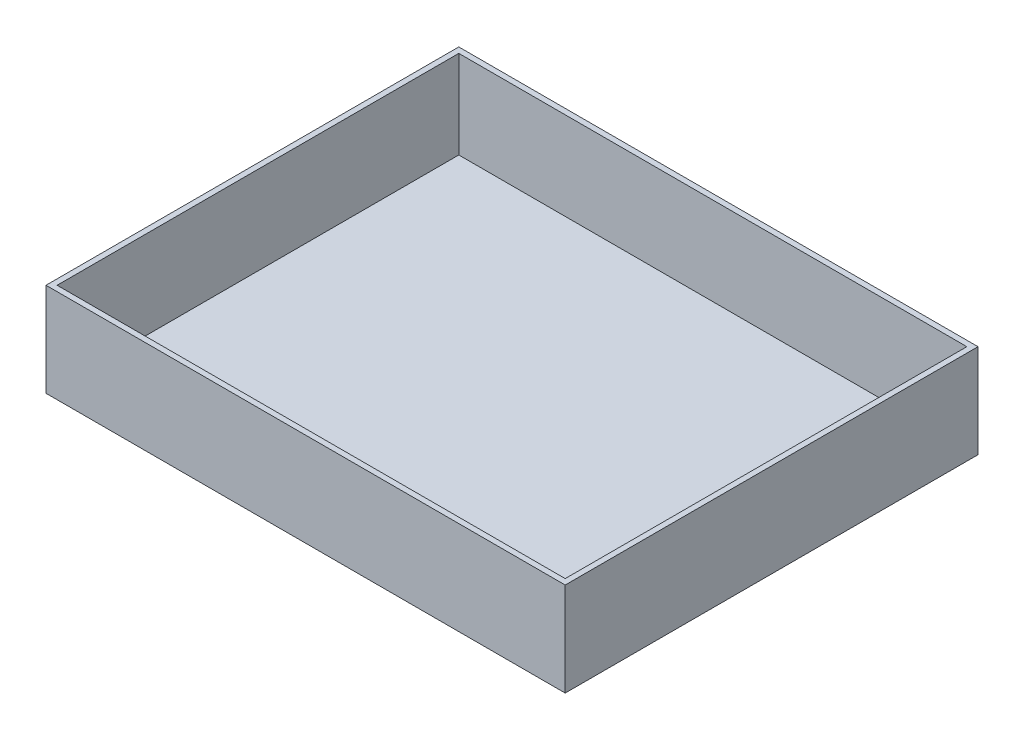
ISO-10303-21;
HEADER;
FILE_DESCRIPTION(('STEP AP214'),'2;1');
FILE_NAME('part.step','',(''),(''),'','','');
FILE_SCHEMA(('AUTOMOTIVE_DESIGN { 1 0 10303 214 1 1 1 1 }'));
ENDSEC;
DATA;
#1=APPLICATION_CONTEXT('core data for automotive mechanical design processes');
#2=APPLICATION_PROTOCOL_DEFINITION('international standard','automotive_design',2000,#1);
#3=PRODUCT_CONTEXT('',#1,'mechanical');
#4=PRODUCT('Part','Part','',(#3));
#5=PRODUCT_RELATED_PRODUCT_CATEGORY('part','',(#4));
#6=PRODUCT_DEFINITION_FORMATION('','',#4);
#7=PRODUCT_DEFINITION_CONTEXT('part definition',#1,'design');
#8=PRODUCT_DEFINITION('design','',#6,#7);
#9=PRODUCT_DEFINITION_SHAPE('','',#8);
#10=(LENGTH_UNIT() NAMED_UNIT(*) SI_UNIT(.MILLI.,.METRE.));
#11=(NAMED_UNIT(*) PLANE_ANGLE_UNIT() SI_UNIT($,.RADIAN.));
#12=(NAMED_UNIT(*) SI_UNIT($,.STERADIAN.) SOLID_ANGLE_UNIT());
#13=UNCERTAINTY_MEASURE_WITH_UNIT(LENGTH_MEASURE(1.E-05),#10,'distance_accuracy_value','');
#14=(GEOMETRIC_REPRESENTATION_CONTEXT(3) GLOBAL_UNCERTAINTY_ASSIGNED_CONTEXT((#13)) GLOBAL_UNIT_ASSIGNED_CONTEXT((#10,
#11,#12)) REPRESENTATION_CONTEXT('',''));
#15=CARTESIAN_POINT('',(0.,0.,0.));
#16=DIRECTION('',(0.,0.,1.));
#17=DIRECTION('',(1.,0.,0.));
#18=AXIS2_PLACEMENT_3D('',#15,#16,#17);
#19=CARTESIAN_POINT('',(0.,84.,0.));
#20=DIRECTION('',(-1.,0.,0.));
#21=DIRECTION('',(0.,0.,1.));
#22=AXIS2_PLACEMENT_3D('',#19,#20,#21);
#23=PLANE('',#22);
#24=DIRECTION('',(0.,0.,-1.));
#25=VECTOR('',#24,1.);
#26=CARTESIAN_POINT('',(0.,0.,0.));
#27=LINE('',#26,#25);
#28=CARTESIAN_POINT('',(0.,0.,0.));
#29=VERTEX_POINT('',#28);
#30=CARTESIAN_POINT('',(0.,0.,-370.5));
#31=VERTEX_POINT('',#30);
#32=EDGE_CURVE('E156',#29,#31,#27,.T.);
#33=ORIENTED_EDGE('',*,*,#32,.F.);
#34=DIRECTION('',(0.,-1.,0.));
#35=VECTOR('',#34,1.);
#36=CARTESIAN_POINT('',(0.,84.,0.));
#37=LINE('',#36,#35);
#38=CARTESIAN_POINT('',(0.,84.,0.));
#39=VERTEX_POINT('',#38);
#40=EDGE_CURVE('E11',#39,#29,#37,.T.);
#41=ORIENTED_EDGE('',*,*,#40,.F.);
#42=DIRECTION('',(0.,0.,-1.));
#43=VECTOR('',#42,1.);
#44=CARTESIAN_POINT('',(0.,84.,0.));
#45=LINE('',#44,#43);
#46=CARTESIAN_POINT('',(0.,84.,-370.5));
#47=VERTEX_POINT('',#46);
#48=EDGE_CURVE('E162',#39,#47,#45,.T.);
#49=ORIENTED_EDGE('',*,*,#48,.T.);
#50=DIRECTION('',(0.,-1.,0.));
#51=VECTOR('',#50,1.);
#52=CARTESIAN_POINT('',(0.,84.,-370.5));
#53=LINE('',#52,#51);
#54=EDGE_CURVE('E42',#47,#31,#53,.T.);
#55=ORIENTED_EDGE('',*,*,#54,.T.);
#56=EDGE_LOOP('',(#33,#41,#49,#55));
#57=FACE_BOUND('',#56,.T.);
#58=ADVANCED_FACE('F39',(#57),#23,.T.);
#59=CARTESIAN_POINT('',(0.,84.,0.));
#60=DIRECTION('',(0.,0.,-1.));
#61=DIRECTION('',(-1.,0.,0.));
#62=AXIS2_PLACEMENT_3D('',#59,#60,#61);
#63=PLANE('',#62);
#64=DIRECTION('',(1.,0.,0.));
#65=VECTOR('',#64,1.);
#66=CARTESIAN_POINT('',(0.,0.,0.));
#67=LINE('',#66,#65);
#68=CARTESIAN_POINT('',(466.,0.,0.));
#69=VERTEX_POINT('',#68);
#70=EDGE_CURVE('E166',#29,#69,#67,.T.);
#71=ORIENTED_EDGE('',*,*,#70,.T.);
#72=DIRECTION('',(0.,-1.,0.));
#73=VECTOR('',#72,1.);
#74=CARTESIAN_POINT('',(466.,84.,0.));
#75=LINE('',#74,#73);
#76=CARTESIAN_POINT('',(466.,84.,0.));
#77=VERTEX_POINT('',#76);
#78=EDGE_CURVE('E48',#77,#69,#75,.T.);
#79=ORIENTED_EDGE('',*,*,#78,.F.);
#80=DIRECTION('',(1.,0.,0.));
#81=VECTOR('',#80,1.);
#82=CARTESIAN_POINT('',(0.,84.,0.));
#83=LINE('',#82,#81);
#84=EDGE_CURVE('E172',#39,#77,#83,.T.);
#85=ORIENTED_EDGE('',*,*,#84,.F.);
#86=ORIENTED_EDGE('',*,*,#40,.T.);
#87=EDGE_LOOP('',(#71,#79,#85,#86));
#88=FACE_BOUND('',#87,.T.);
#89=ADVANCED_FACE('F200',(#88),#63,.F.);
#90=CARTESIAN_POINT('',(466.,84.,0.));
#91=DIRECTION('',(-1.,0.,0.));
#92=DIRECTION('',(0.,0.,1.));
#93=AXIS2_PLACEMENT_3D('',#90,#91,#92);
#94=PLANE('',#93);
#95=DIRECTION('',(0.,0.,-1.));
#96=VECTOR('',#95,1.);
#97=CARTESIAN_POINT('',(466.,0.,0.));
#98=LINE('',#97,#96);
#99=CARTESIAN_POINT('',(466.,0.,-370.5));
#100=VERTEX_POINT('',#99);
#101=EDGE_CURVE('E182',#69,#100,#98,.T.);
#102=ORIENTED_EDGE('',*,*,#101,.T.);
#103=DIRECTION('',(0.,-1.,0.));
#104=VECTOR('',#103,1.);
#105=CARTESIAN_POINT('',(466.,84.,-370.5));
#106=LINE('',#105,#104);
#107=CARTESIAN_POINT('',(466.,84.,-370.5));
#108=VERTEX_POINT('',#107);
#109=EDGE_CURVE('E190',#108,#100,#106,.T.);
#110=ORIENTED_EDGE('',*,*,#109,.F.);
#111=DIRECTION('',(0.,0.,-1.));
#112=VECTOR('',#111,1.);
#113=CARTESIAN_POINT('',(466.,84.,0.));
#114=LINE('',#113,#112);
#115=EDGE_CURVE('E169',#77,#108,#114,.T.);
#116=ORIENTED_EDGE('',*,*,#115,.F.);
#117=ORIENTED_EDGE('',*,*,#78,.T.);
#118=EDGE_LOOP('',(#102,#110,#116,#117));
#119=FACE_BOUND('',#118,.T.);
#120=ADVANCED_FACE('F203',(#119),#94,.F.);
#121=CARTESIAN_POINT('',(0.,84.,-370.5));
#122=DIRECTION('',(0.,0.,-1.));
#123=DIRECTION('',(-1.,0.,0.));
#124=AXIS2_PLACEMENT_3D('',#121,#122,#123);
#125=PLANE('',#124);
#126=DIRECTION('',(1.,0.,0.));
#127=VECTOR('',#126,1.);
#128=CARTESIAN_POINT('',(0.,0.,-370.5));
#129=LINE('',#128,#127);
#130=EDGE_CURVE('E178',#31,#100,#129,.T.);
#131=ORIENTED_EDGE('',*,*,#130,.F.);
#132=ORIENTED_EDGE('',*,*,#54,.F.);
#133=DIRECTION('',(1.,0.,0.));
#134=VECTOR('',#133,1.);
#135=CARTESIAN_POINT('',(0.,84.,-370.5));
#136=LINE('',#135,#134);
#137=EDGE_CURVE('E165',#47,#108,#136,.T.);
#138=ORIENTED_EDGE('',*,*,#137,.T.);
#139=ORIENTED_EDGE('',*,*,#109,.T.);
#140=EDGE_LOOP('',(#131,#132,#138,#139));
#141=FACE_BOUND('',#140,.T.);
#142=ADVANCED_FACE('F195',(#141),#125,.T.);
#143=CARTESIAN_POINT('',(0.,84.,0.));
#144=DIRECTION('',(0.,-1.,0.));
#145=DIRECTION('',(0.,0.,-1.));
#146=AXIS2_PLACEMENT_3D('',#143,#144,#145);
#147=PLANE('',#146);
#148=DIRECTION('',(1.,0.,0.));
#149=VECTOR('',#148,1.);
#150=CARTESIAN_POINT('',(5.,84.,-5.));
#151=LINE('',#150,#149);
#152=CARTESIAN_POINT('',(5.,84.,-5.));
#153=VERTEX_POINT('',#152);
#154=CARTESIAN_POINT('',(461.,84.,-5.));
#155=VERTEX_POINT('',#154);
#156=EDGE_CURVE('E147',#153,#155,#151,.T.);
#157=ORIENTED_EDGE('',*,*,#156,.F.);
#158=DIRECTION('',(0.,0.,1.));
#159=VECTOR('',#158,1.);
#160=CARTESIAN_POINT('',(5.,84.,-5.));
#161=LINE('',#160,#159);
#162=CARTESIAN_POINT('',(5.,84.,-365.5));
#163=VERTEX_POINT('',#162);
#164=EDGE_CURVE('E56',#163,#153,#161,.T.);
#165=ORIENTED_EDGE('',*,*,#164,.F.);
#166=DIRECTION('',(-1.,0.,0.));
#167=VECTOR('',#166,1.);
#168=CARTESIAN_POINT('',(5.,84.,-365.5));
#169=LINE('',#168,#167);
#170=CARTESIAN_POINT('',(461.,84.,-365.5));
#171=VERTEX_POINT('',#170);
#172=EDGE_CURVE('E134',#171,#163,#169,.T.);
#173=ORIENTED_EDGE('',*,*,#172,.F.);
#174=DIRECTION('',(0.,0.,-1.));
#175=VECTOR('',#174,1.);
#176=CARTESIAN_POINT('',(461.,84.,-5.));
#177=LINE('',#176,#175);
#178=EDGE_CURVE('E138',#155,#171,#177,.T.);
#179=ORIENTED_EDGE('',*,*,#178,.F.);
#180=EDGE_LOOP('',(#157,#165,#173,#179));
#181=FACE_BOUND('',#180,.T.);
#182=ORIENTED_EDGE('',*,*,#48,.F.);
#183=ORIENTED_EDGE('',*,*,#84,.T.);
#184=ORIENTED_EDGE('',*,*,#115,.T.);
#185=ORIENTED_EDGE('',*,*,#137,.F.);
#186=EDGE_LOOP('',(#182,#183,#184,#185));
#187=FACE_BOUND('',#186,.T.);
#188=ADVANCED_FACE('F205',(#181,#187),#147,.F.);
#189=CARTESIAN_POINT('',(0.,0.,0.));
#190=DIRECTION('',(0.,-1.,0.));
#191=DIRECTION('',(0.,0.,-1.));
#192=AXIS2_PLACEMENT_3D('',#189,#190,#191);
#193=PLANE('',#192);
#194=ORIENTED_EDGE('',*,*,#32,.T.);
#195=ORIENTED_EDGE('',*,*,#130,.T.);
#196=ORIENTED_EDGE('',*,*,#101,.F.);
#197=ORIENTED_EDGE('',*,*,#70,.F.);
#198=EDGE_LOOP('',(#194,#195,#196,#197));
#199=FACE_BOUND('',#198,.T.);
#200=ADVANCED_FACE('F198',(#199),#193,.T.);
#201=CARTESIAN_POINT('',(5.,5.,-5.));
#202=DIRECTION('',(-1.,0.,0.));
#203=DIRECTION('',(0.,0.,1.));
#204=AXIS2_PLACEMENT_3D('',#201,#202,#203);
#205=PLANE('',#204);
#206=ORIENTED_EDGE('',*,*,#164,.T.);
#207=DIRECTION('',(0.,1.,0.));
#208=VECTOR('',#207,1.);
#209=CARTESIAN_POINT('',(5.,5.,-5.));
#210=LINE('',#209,#208);
#211=CARTESIAN_POINT('',(5.,5.,-5.));
#212=VERTEX_POINT('',#211);
#213=EDGE_CURVE('E109',#212,#153,#210,.T.);
#214=ORIENTED_EDGE('',*,*,#213,.F.);
#215=DIRECTION('',(0.,0.,1.));
#216=VECTOR('',#215,1.);
#217=CARTESIAN_POINT('',(5.,5.,-5.));
#218=LINE('',#217,#216);
#219=CARTESIAN_POINT('',(5.,5.,-365.5));
#220=VERTEX_POINT('',#219);
#221=EDGE_CURVE('E113',#220,#212,#218,.T.);
#222=ORIENTED_EDGE('',*,*,#221,.F.);
#223=DIRECTION('',(0.,1.,0.));
#224=VECTOR('',#223,1.);
#225=CARTESIAN_POINT('',(5.,5.,-365.5));
#226=LINE('',#225,#224);
#227=EDGE_CURVE('E153',#220,#163,#226,.T.);
#228=ORIENTED_EDGE('',*,*,#227,.T.);
#229=EDGE_LOOP('',(#206,#214,#222,#228));
#230=FACE_BOUND('',#229,.T.);
#231=ADVANCED_FACE('F111',(#230),#205,.F.);
#232=CARTESIAN_POINT('',(5.,5.,-365.5));
#233=DIRECTION('',(0.,0.,-1.));
#234=DIRECTION('',(-1.,0.,0.));
#235=AXIS2_PLACEMENT_3D('',#232,#233,#234);
#236=PLANE('',#235);
#237=ORIENTED_EDGE('',*,*,#172,.T.);
#238=ORIENTED_EDGE('',*,*,#227,.F.);
#239=DIRECTION('',(-1.,0.,0.));
#240=VECTOR('',#239,1.);
#241=CARTESIAN_POINT('',(5.,5.,-365.5));
#242=LINE('',#241,#240);
#243=CARTESIAN_POINT('',(461.,5.,-365.5));
#244=VERTEX_POINT('',#243);
#245=EDGE_CURVE('E120',#244,#220,#242,.T.);
#246=ORIENTED_EDGE('',*,*,#245,.F.);
#247=DIRECTION('',(0.,1.,0.));
#248=VECTOR('',#247,1.);
#249=CARTESIAN_POINT('',(461.,5.,-365.5));
#250=LINE('',#249,#248);
#251=EDGE_CURVE('E157',#244,#171,#250,.T.);
#252=ORIENTED_EDGE('',*,*,#251,.T.);
#253=EDGE_LOOP('',(#237,#238,#246,#252));
#254=FACE_BOUND('',#253,.T.);
#255=ADVANCED_FACE('F249',(#254),#236,.F.);
#256=CARTESIAN_POINT('',(461.,5.,-5.));
#257=DIRECTION('',(1.,0.,0.));
#258=DIRECTION('',(0.,0.,-1.));
#259=AXIS2_PLACEMENT_3D('',#256,#257,#258);
#260=PLANE('',#259);
#261=ORIENTED_EDGE('',*,*,#178,.T.);
#262=ORIENTED_EDGE('',*,*,#251,.F.);
#263=DIRECTION('',(0.,0.,-1.));
#264=VECTOR('',#263,1.);
#265=CARTESIAN_POINT('',(461.,5.,-5.));
#266=LINE('',#265,#264);
#267=CARTESIAN_POINT('',(461.,5.,-5.));
#268=VERTEX_POINT('',#267);
#269=EDGE_CURVE('E129',#268,#244,#266,.T.);
#270=ORIENTED_EDGE('',*,*,#269,.F.);
#271=DIRECTION('',(0.,1.,0.));
#272=VECTOR('',#271,1.);
#273=CARTESIAN_POINT('',(461.,5.,-5.));
#274=LINE('',#273,#272);
#275=EDGE_CURVE('E119',#268,#155,#274,.T.);
#276=ORIENTED_EDGE('',*,*,#275,.T.);
#277=EDGE_LOOP('',(#261,#262,#270,#276));
#278=FACE_BOUND('',#277,.T.);
#279=ADVANCED_FACE('F257',(#278),#260,.F.);
#280=CARTESIAN_POINT('',(5.,5.,-5.));
#281=DIRECTION('',(0.,0.,1.));
#282=DIRECTION('',(1.,0.,0.));
#283=AXIS2_PLACEMENT_3D('',#280,#281,#282);
#284=PLANE('',#283);
#285=ORIENTED_EDGE('',*,*,#156,.T.);
#286=ORIENTED_EDGE('',*,*,#275,.F.);
#287=DIRECTION('',(1.,0.,0.));
#288=VECTOR('',#287,1.);
#289=CARTESIAN_POINT('',(5.,5.,-5.));
#290=LINE('',#289,#288);
#291=EDGE_CURVE('E123',#212,#268,#290,.T.);
#292=ORIENTED_EDGE('',*,*,#291,.F.);
#293=ORIENTED_EDGE('',*,*,#213,.T.);
#294=EDGE_LOOP('',(#285,#286,#292,#293));
#295=FACE_BOUND('',#294,.T.);
#296=ADVANCED_FACE('F124',(#295),#284,.F.);
#297=CARTESIAN_POINT('',(0.,5.,0.));
#298=DIRECTION('',(0.,-1.,0.));
#299=DIRECTION('',(0.,0.,-1.));
#300=AXIS2_PLACEMENT_3D('',#297,#298,#299);
#301=PLANE('',#300);
#302=ORIENTED_EDGE('',*,*,#221,.T.);
#303=ORIENTED_EDGE('',*,*,#291,.T.);
#304=ORIENTED_EDGE('',*,*,#269,.T.);
#305=ORIENTED_EDGE('',*,*,#245,.T.);
#306=EDGE_LOOP('',(#302,#303,#304,#305));
#307=FACE_BOUND('',#306,.T.);
#308=ADVANCED_FACE('F131',(#307),#301,.F.);
#309=CLOSED_SHELL('',(#58,#89,#120,#142,#188,#200,#231,#255,#279,#296,#308));
#310=MANIFOLD_SOLID_BREP('B2',#309);
#311=ADVANCED_BREP_SHAPE_REPRESENTATION('',(#18,#310),#14);
#312=SHAPE_DEFINITION_REPRESENTATION(#9,#311);
ENDSEC;
END-ISO-10303-21;
